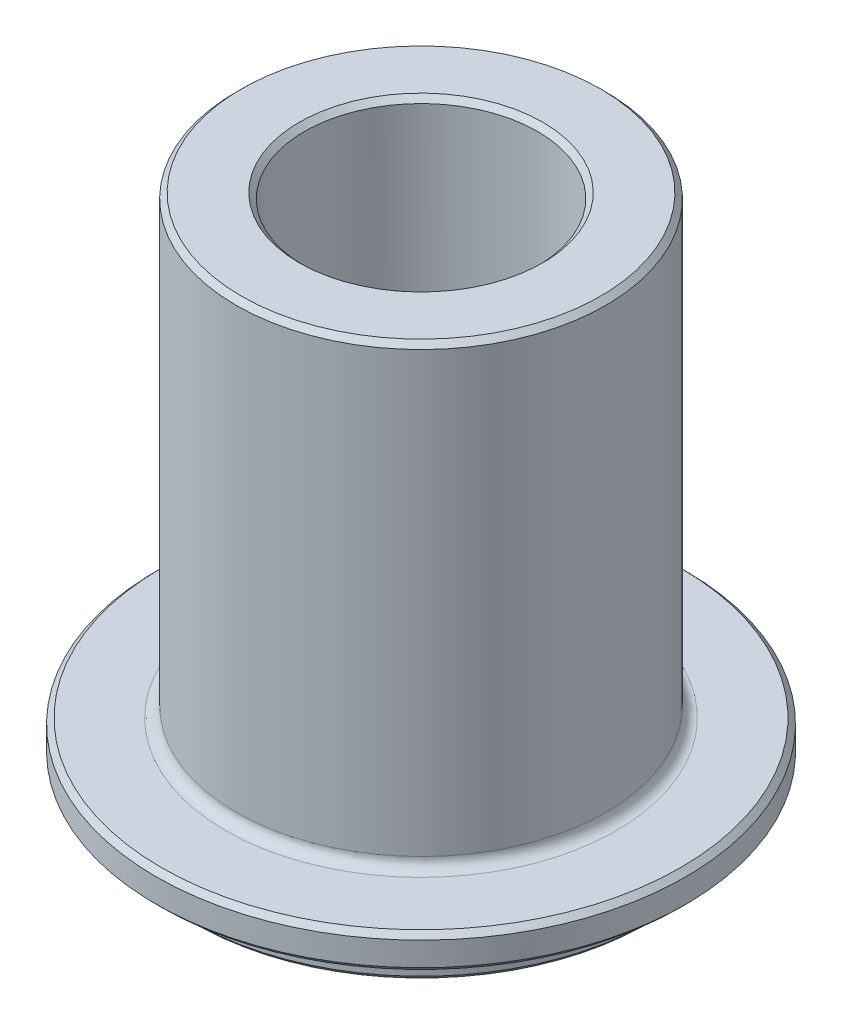
ISO-10303-21;
HEADER;
FILE_DESCRIPTION(('STEP AP214'),'2;1');
FILE_NAME('part.step','',(''),(''),'','','');
FILE_SCHEMA(('AUTOMOTIVE_DESIGN { 1 0 10303 214 1 1 1 1 }'));
ENDSEC;
DATA;
#1=APPLICATION_CONTEXT('core data for automotive mechanical design processes');
#2=APPLICATION_PROTOCOL_DEFINITION('international standard','automotive_design',2000,#1);
#3=PRODUCT_CONTEXT('',#1,'mechanical');
#4=PRODUCT('Part','Part','',(#3));
#5=PRODUCT_RELATED_PRODUCT_CATEGORY('part','',(#4));
#6=PRODUCT_DEFINITION_FORMATION('','',#4);
#7=PRODUCT_DEFINITION_CONTEXT('part definition',#1,'design');
#8=PRODUCT_DEFINITION('design','',#6,#7);
#9=PRODUCT_DEFINITION_SHAPE('','',#8);
#10=(LENGTH_UNIT() NAMED_UNIT(*) SI_UNIT(.MILLI.,.METRE.));
#11=(NAMED_UNIT(*) PLANE_ANGLE_UNIT() SI_UNIT($,.RADIAN.));
#12=(NAMED_UNIT(*) SI_UNIT($,.STERADIAN.) SOLID_ANGLE_UNIT());
#13=UNCERTAINTY_MEASURE_WITH_UNIT(LENGTH_MEASURE(1.E-05),#10,'distance_accuracy_value','');
#14=(GEOMETRIC_REPRESENTATION_CONTEXT(3) GLOBAL_UNCERTAINTY_ASSIGNED_CONTEXT((#13)) GLOBAL_UNIT_ASSIGNED_CONTEXT((#10,
#11,#12)) REPRESENTATION_CONTEXT('',''));
#15=CARTESIAN_POINT('',(0.,0.,0.));
#16=DIRECTION('',(0.,0.,1.));
#17=DIRECTION('',(1.,0.,0.));
#18=AXIS2_PLACEMENT_3D('',#15,#16,#17);
#19=CARTESIAN_POINT('',(0.,27.8,0.));
#20=DIRECTION('',(0.,1.,0.));
#21=DIRECTION('',(0.,0.,1.));
#22=AXIS2_PLACEMENT_3D('',#19,#20,#21);
#23=CONICAL_SURFACE('',#22,1.49303844590048,1.0518523930485);
#24=CARTESIAN_POINT('',(0.,33.23,0.));
#25=DIRECTION('',(0.,-1.,0.));
#26=DIRECTION('',(0.,0.,-1.));
#27=AXIS2_PLACEMENT_3D('',#24,#25,#26);
#28=CIRCLE('',#27,11.);
#29=CARTESIAN_POINT('',(0.,33.23,-11.));
#30=VERTEX_POINT('',#29);
#31=EDGE_CURVE('E130',#30,#30,#28,.T.);
#32=ORIENTED_EDGE('',*,*,#31,.F.);
#33=EDGE_LOOP('',(#32));
#34=FACE_BOUND('',#33,.T.);
#35=CARTESIAN_POINT('',(0.,27.8,0.));
#36=DIRECTION('',(0.,-1.,0.));
#37=DIRECTION('',(0.,0.,-1.));
#38=AXIS2_PLACEMENT_3D('',#35,#36,#37);
#39=CIRCLE('',#38,1.49303844590048);
#40=CARTESIAN_POINT('',(0.,27.8,-1.49303844590048));
#41=VERTEX_POINT('',#40);
#42=EDGE_CURVE('E122',#41,#41,#39,.T.);
#43=ORIENTED_EDGE('',*,*,#42,.T.);
#44=EDGE_LOOP('',(#43));
#45=FACE_BOUND('',#44,.T.);
#46=ADVANCED_FACE('F41',(#34,#45),#23,.F.);
#47=CARTESIAN_POINT('',(0.,0.,0.));
#48=DIRECTION('',(0.,-1.,0.));
#49=DIRECTION('',(0.,0.,-1.));
#50=AXIS2_PLACEMENT_3D('',#47,#48,#49);
#51=CYLINDRICAL_SURFACE('',#50,1.49303844590048);
#52=CARTESIAN_POINT('',(0.,25.8,0.));
#53=DIRECTION('',(0.,1.,0.));
#54=DIRECTION('',(0.,0.,1.));
#55=AXIS2_PLACEMENT_3D('',#52,#53,#54);
#56=CIRCLE('',#55,1.49303844590048);
#57=CARTESIAN_POINT('',(0.,25.8,1.49303844590048));
#58=VERTEX_POINT('',#57);
#59=EDGE_CURVE('E86',#58,#58,#56,.F.);
#60=ORIENTED_EDGE('',*,*,#59,.T.);
#61=EDGE_LOOP('',(#60));
#62=FACE_BOUND('',#61,.T.);
#63=ORIENTED_EDGE('',*,*,#42,.F.);
#64=EDGE_LOOP('',(#63));
#65=FACE_BOUND('',#64,.T.);
#66=ADVANCED_FACE('F139',(#62,#65),#51,.F.);
#67=CARTESIAN_POINT('',(0.,25.3,0.));
#68=DIRECTION('',(0.,1.,0.));
#69=DIRECTION('',(0.,0.,1.));
#70=AXIS2_PLACEMENT_3D('',#67,#68,#69);
#71=PLANE('',#70);
#72=CARTESIAN_POINT('',(0.,25.3,0.));
#73=DIRECTION('',(0.,1.,0.));
#74=DIRECTION('',(0.,0.,1.));
#75=AXIS2_PLACEMENT_3D('',#72,#73,#74);
#76=CIRCLE('',#75,11.8346398960364);
#77=CARTESIAN_POINT('',(0.,25.3,11.8346398960364));
#78=VERTEX_POINT('',#77);
#79=EDGE_CURVE('E50',#78,#78,#76,.F.);
#80=ORIENTED_EDGE('',*,*,#79,.T.);
#81=EDGE_LOOP('',(#80));
#82=FACE_BOUND('',#81,.T.);
#83=CARTESIAN_POINT('',(0.,25.3,0.));
#84=DIRECTION('',(0.,1.,0.));
#85=DIRECTION('',(0.,0.,1.));
#86=AXIS2_PLACEMENT_3D('',#83,#84,#85);
#87=CIRCLE('',#86,1.9930384459005);
#88=CARTESIAN_POINT('',(0.,25.3,1.9930384459005));
#89=VERTEX_POINT('',#88);
#90=EDGE_CURVE('E82',#89,#89,#87,.T.);
#91=ORIENTED_EDGE('',*,*,#90,.T.);
#92=EDGE_LOOP('',(#91));
#93=FACE_BOUND('',#92,.T.);
#94=ADVANCED_FACE('F144',(#82,#93),#71,.F.);
#95=CARTESIAN_POINT('',(0.,0.,0.));
#96=DIRECTION('',(0.,-1.,0.));
#97=DIRECTION('',(0.,0.,-1.));
#98=AXIS2_PLACEMENT_3D('',#95,#96,#97);
#99=CYLINDRICAL_SURFACE('',#98,12.3346398960364);
#100=CARTESIAN_POINT('',(0.,24.8,0.));
#101=DIRECTION('',(0.,1.,0.));
#102=DIRECTION('',(0.,0.,1.));
#103=AXIS2_PLACEMENT_3D('',#100,#101,#102);
#104=CIRCLE('',#103,12.3346398960364);
#105=CARTESIAN_POINT('',(0.,24.8,12.3346398960364));
#106=VERTEX_POINT('',#105);
#107=EDGE_CURVE('E10',#106,#106,#104,.T.);
#108=ORIENTED_EDGE('',*,*,#107,.T.);
#109=EDGE_LOOP('',(#108));
#110=FACE_BOUND('',#109,.T.);
#111=CARTESIAN_POINT('',(0.,0.500000000000023,0.));
#112=DIRECTION('',(0.,-1.,0.));
#113=DIRECTION('',(0.,0.,-1.));
#114=AXIS2_PLACEMENT_3D('',#111,#112,#113);
#115=CIRCLE('',#114,12.3346398960364);
#116=CARTESIAN_POINT('',(0.,0.500000000000023,-12.3346398960364));
#117=VERTEX_POINT('',#116);
#118=EDGE_CURVE('E90',#117,#117,#115,.T.);
#119=ORIENTED_EDGE('',*,*,#118,.T.);
#120=EDGE_LOOP('',(#119));
#121=FACE_BOUND('',#120,.T.);
#122=ADVANCED_FACE('F150',(#110,#121),#99,.F.);
#123=CARTESIAN_POINT('',(0.,0.,0.));
#124=DIRECTION('',(0.,-1.,0.));
#125=DIRECTION('',(0.,0.,-1.));
#126=AXIS2_PLACEMENT_3D('',#123,#124,#125);
#127=PLANE('',#126);
#128=CARTESIAN_POINT('',(0.,0.,0.));
#129=DIRECTION('',(0.,-1.,0.));
#130=DIRECTION('',(0.,0.,-1.));
#131=AXIS2_PLACEMENT_3D('',#128,#129,#130);
#132=CIRCLE('',#131,21.25);
#133=CARTESIAN_POINT('',(0.,0.,-21.25));
#134=VERTEX_POINT('',#133);
#135=EDGE_CURVE('E98',#134,#134,#132,.T.);
#136=ORIENTED_EDGE('',*,*,#135,.T.);
#137=EDGE_LOOP('',(#136));
#138=FACE_BOUND('',#137,.T.);
#139=CARTESIAN_POINT('',(0.,0.,0.));
#140=DIRECTION('',(0.,-1.,0.));
#141=DIRECTION('',(0.,0.,-1.));
#142=AXIS2_PLACEMENT_3D('',#139,#140,#141);
#143=CIRCLE('',#142,12.8346398960364);
#144=CARTESIAN_POINT('',(0.,0.,-12.8346398960364));
#145=VERTEX_POINT('',#144);
#146=EDGE_CURVE('E102',#145,#145,#143,.F.);
#147=ORIENTED_EDGE('',*,*,#146,.T.);
#148=EDGE_LOOP('',(#147));
#149=FACE_BOUND('',#148,.T.);
#150=ADVANCED_FACE('F238',(#138,#149),#127,.T.);
#151=CARTESIAN_POINT('',(0.,0.,0.));
#152=DIRECTION('',(0.,-1.,0.));
#153=DIRECTION('',(0.,0.,-1.));
#154=AXIS2_PLACEMENT_3D('',#151,#152,#153);
#155=CYLINDRICAL_SURFACE('',#154,21.75);
#156=CARTESIAN_POINT('',(0.,0.500000000000004,0.));
#157=DIRECTION('',(0.,-1.,0.));
#158=DIRECTION('',(0.,0.,-1.));
#159=AXIS2_PLACEMENT_3D('',#156,#157,#158);
#160=CIRCLE('',#159,21.75);
#161=CARTESIAN_POINT('',(0.,0.500000000000004,-21.75));
#162=VERTEX_POINT('',#161);
#163=EDGE_CURVE('E94',#162,#162,#160,.F.);
#164=ORIENTED_EDGE('',*,*,#163,.T.);
#165=EDGE_LOOP('',(#164));
#166=FACE_BOUND('',#165,.T.);
#167=CARTESIAN_POINT('',(0.,3.,0.));
#168=DIRECTION('',(0.,-1.,0.));
#169=DIRECTION('',(0.,0.,-1.));
#170=AXIS2_PLACEMENT_3D('',#167,#168,#169);
#171=CIRCLE('',#170,21.75);
#172=CARTESIAN_POINT('',(0.,3.,-21.75));
#173=VERTEX_POINT('',#172);
#174=EDGE_CURVE('E126',#173,#173,#171,.T.);
#175=ORIENTED_EDGE('',*,*,#174,.T.);
#176=EDGE_LOOP('',(#175));
#177=FACE_BOUND('',#176,.T.);
#178=ADVANCED_FACE('F233',(#166,#177),#155,.T.);
#179=CARTESIAN_POINT('',(0.,3.,0.));
#180=DIRECTION('',(0.,-1.,0.));
#181=DIRECTION('',(0.,0.,-1.));
#182=AXIS2_PLACEMENT_3D('',#179,#180,#181);
#183=PLANE('',#182);
#184=CARTESIAN_POINT('',(0.,3.,0.));
#185=DIRECTION('',(0.,-1.,0.));
#186=DIRECTION('',(0.,0.,-1.));
#187=AXIS2_PLACEMENT_3D('',#184,#185,#186);
#188=CIRCLE('',#187,24.5);
#189=CARTESIAN_POINT('',(0.,3.,-24.5));
#190=VERTEX_POINT('',#189);
#191=EDGE_CURVE('E106',#190,#190,#188,.T.);
#192=ORIENTED_EDGE('',*,*,#191,.T.);
#193=EDGE_LOOP('',(#192));
#194=FACE_BOUND('',#193,.T.);
#195=ORIENTED_EDGE('',*,*,#174,.F.);
#196=EDGE_LOOP('',(#195));
#197=FACE_BOUND('',#196,.T.);
#198=ADVANCED_FACE('F225',(#194,#197),#183,.T.);
#199=CARTESIAN_POINT('',(0.,0.,0.));
#200=DIRECTION('',(0.,-1.,0.));
#201=DIRECTION('',(0.,0.,-1.));
#202=AXIS2_PLACEMENT_3D('',#199,#200,#201);
#203=CYLINDRICAL_SURFACE('',#202,25.);
#204=CARTESIAN_POINT('',(0.,5.74999999999999,0.));
#205=DIRECTION('',(0.,1.,0.));
#206=DIRECTION('',(0.,0.,1.));
#207=AXIS2_PLACEMENT_3D('',#204,#205,#206);
#208=CIRCLE('',#207,25.);
#209=CARTESIAN_POINT('',(0.,5.74999999999999,25.));
#210=VERTEX_POINT('',#209);
#211=EDGE_CURVE('E114',#210,#210,#208,.F.);
#212=ORIENTED_EDGE('',*,*,#211,.T.);
#213=EDGE_LOOP('',(#212));
#214=FACE_BOUND('',#213,.T.);
#215=CARTESIAN_POINT('',(0.,3.5,0.));
#216=DIRECTION('',(0.,-1.,0.));
#217=DIRECTION('',(0.,0.,-1.));
#218=AXIS2_PLACEMENT_3D('',#215,#216,#217);
#219=CIRCLE('',#218,25.);
#220=CARTESIAN_POINT('',(0.,3.5,-25.));
#221=VERTEX_POINT('',#220);
#222=EDGE_CURVE('E118',#221,#221,#219,.F.);
#223=ORIENTED_EDGE('',*,*,#222,.T.);
#224=EDGE_LOOP('',(#223));
#225=FACE_BOUND('',#224,.T.);
#226=ADVANCED_FACE('F217',(#214,#225),#203,.T.);
#227=CARTESIAN_POINT('',(0.,6.25,0.));
#228=DIRECTION('',(0.,1.,0.));
#229=DIRECTION('',(0.,0.,1.));
#230=AXIS2_PLACEMENT_3D('',#227,#228,#229);
#231=PLANE('',#230);
#232=CARTESIAN_POINT('',(0.,6.25,0.));
#233=DIRECTION('',(0.,1.,0.));
#234=DIRECTION('',(0.,0.,1.));
#235=AXIS2_PLACEMENT_3D('',#232,#233,#234);
#236=CIRCLE('',#235,18.45);
#237=CARTESIAN_POINT('',(0.,6.25,18.45));
#238=VERTEX_POINT('',#237);
#239=EDGE_CURVE('E60',#238,#238,#236,.F.);
#240=ORIENTED_EDGE('',*,*,#239,.T.);
#241=EDGE_LOOP('',(#240));
#242=FACE_BOUND('',#241,.T.);
#243=CARTESIAN_POINT('',(0.,6.25,0.));
#244=DIRECTION('',(0.,1.,0.));
#245=DIRECTION('',(0.,0.,1.));
#246=AXIS2_PLACEMENT_3D('',#243,#244,#245);
#247=CIRCLE('',#246,24.5);
#248=CARTESIAN_POINT('',(0.,6.25,24.5));
#249=VERTEX_POINT('',#248);
#250=EDGE_CURVE('E110',#249,#249,#247,.T.);
#251=ORIENTED_EDGE('',*,*,#250,.T.);
#252=EDGE_LOOP('',(#251));
#253=FACE_BOUND('',#252,.T.);
#254=ADVANCED_FACE('F213',(#242,#253),#231,.T.);
#255=CARTESIAN_POINT('',(0.,0.,0.));
#256=DIRECTION('',(0.,-1.,0.));
#257=DIRECTION('',(0.,0.,-1.));
#258=AXIS2_PLACEMENT_3D('',#255,#256,#257);
#259=CYLINDRICAL_SURFACE('',#258,17.45);
#260=CARTESIAN_POINT('',(0.,7.25,0.));
#261=DIRECTION('',(0.,1.,0.));
#262=DIRECTION('',(0.,0.,1.));
#263=AXIS2_PLACEMENT_3D('',#260,#261,#262);
#264=CIRCLE('',#263,17.45);
#265=CARTESIAN_POINT('',(0.,7.25,17.45));
#266=VERTEX_POINT('',#265);
#267=EDGE_CURVE('E55',#266,#266,#264,.T.);
#268=ORIENTED_EDGE('',*,*,#267,.T.);
#269=EDGE_LOOP('',(#268));
#270=FACE_BOUND('',#269,.T.);
#271=CARTESIAN_POINT('',(0.,48.7,0.));
#272=DIRECTION('',(0.,1.,0.));
#273=DIRECTION('',(0.,0.,1.));
#274=AXIS2_PLACEMENT_3D('',#271,#272,#273);
#275=CIRCLE('',#274,17.45);
#276=CARTESIAN_POINT('',(0.,48.7,17.45));
#277=VERTEX_POINT('',#276);
#278=EDGE_CURVE('E66',#277,#277,#275,.F.);
#279=ORIENTED_EDGE('',*,*,#278,.T.);
#280=EDGE_LOOP('',(#279));
#281=FACE_BOUND('',#280,.T.);
#282=ADVANCED_FACE('F216',(#270,#281),#259,.T.);
#283=CARTESIAN_POINT('',(0.,49.2,0.));
#284=DIRECTION('',(0.,1.,0.));
#285=DIRECTION('',(0.,0.,1.));
#286=AXIS2_PLACEMENT_3D('',#283,#284,#285);
#287=PLANE('',#286);
#288=CARTESIAN_POINT('',(0.,49.2,0.));
#289=DIRECTION('',(0.,1.,0.));
#290=DIRECTION('',(0.,0.,1.));
#291=AXIS2_PLACEMENT_3D('',#288,#289,#290);
#292=CIRCLE('',#291,11.5);
#293=CARTESIAN_POINT('',(0.,49.2,11.5));
#294=VERTEX_POINT('',#293);
#295=EDGE_CURVE('E74',#294,#294,#292,.F.);
#296=ORIENTED_EDGE('',*,*,#295,.T.);
#297=EDGE_LOOP('',(#296));
#298=FACE_BOUND('',#297,.T.);
#299=CARTESIAN_POINT('',(0.,49.2,0.));
#300=DIRECTION('',(0.,1.,0.));
#301=DIRECTION('',(0.,0.,1.));
#302=AXIS2_PLACEMENT_3D('',#299,#300,#301);
#303=CIRCLE('',#302,16.95);
#304=CARTESIAN_POINT('',(0.,49.2,16.95));
#305=VERTEX_POINT('',#304);
#306=EDGE_CURVE('E78',#305,#305,#303,.T.);
#307=ORIENTED_EDGE('',*,*,#306,.T.);
#308=EDGE_LOOP('',(#307));
#309=FACE_BOUND('',#308,.T.);
#310=ADVANCED_FACE('F284',(#298,#309),#287,.T.);
#311=CARTESIAN_POINT('',(0.,0.,0.));
#312=DIRECTION('',(0.,-1.,0.));
#313=DIRECTION('',(0.,0.,-1.));
#314=AXIS2_PLACEMENT_3D('',#311,#312,#313);
#315=CYLINDRICAL_SURFACE('',#314,11.);
#316=CARTESIAN_POINT('',(0.,48.7,0.));
#317=DIRECTION('',(0.,1.,0.));
#318=DIRECTION('',(0.,0.,1.));
#319=AXIS2_PLACEMENT_3D('',#316,#317,#318);
#320=CIRCLE('',#319,11.);
#321=CARTESIAN_POINT('',(0.,48.7,11.));
#322=VERTEX_POINT('',#321);
#323=EDGE_CURVE('E70',#322,#322,#320,.T.);
#324=ORIENTED_EDGE('',*,*,#323,.T.);
#325=EDGE_LOOP('',(#324));
#326=FACE_BOUND('',#325,.T.);
#327=ORIENTED_EDGE('',*,*,#31,.T.);
#328=EDGE_LOOP('',(#327));
#329=FACE_BOUND('',#328,.T.);
#330=ADVANCED_FACE('F135',(#326,#329),#315,.F.);
#331=CARTESIAN_POINT('',(0.,5.74999999999999,0.));
#332=DIRECTION('',(0.,-1.,0.));
#333=DIRECTION('',(0.,0.,-1.));
#334=AXIS2_PLACEMENT_3D('',#331,#332,#333);
#335=CONICAL_SURFACE('',#334,25.,0.785398163397452);
#336=ORIENTED_EDGE('',*,*,#250,.F.);
#337=EDGE_LOOP('',(#336));
#338=FACE_BOUND('',#337,.T.);
#339=ORIENTED_EDGE('',*,*,#211,.F.);
#340=EDGE_LOOP('',(#339));
#341=FACE_BOUND('',#340,.T.);
#342=ADVANCED_FACE('F155',(#338,#341),#335,.T.);
#343=CARTESIAN_POINT('',(0.,3.,0.));
#344=DIRECTION('',(0.,1.,0.));
#345=DIRECTION('',(0.,0.,1.));
#346=AXIS2_PLACEMENT_3D('',#343,#344,#345);
#347=CONICAL_SURFACE('',#346,24.5,0.785398163397438);
#348=ORIENTED_EDGE('',*,*,#222,.F.);
#349=EDGE_LOOP('',(#348));
#350=FACE_BOUND('',#349,.T.);
#351=ORIENTED_EDGE('',*,*,#191,.F.);
#352=EDGE_LOOP('',(#351));
#353=FACE_BOUND('',#352,.T.);
#354=ADVANCED_FACE('F161',(#350,#353),#347,.T.);
#355=CARTESIAN_POINT('',(0.,0.,0.));
#356=DIRECTION('',(0.,1.,0.));
#357=DIRECTION('',(0.,0.,1.));
#358=AXIS2_PLACEMENT_3D('',#355,#356,#357);
#359=CONICAL_SURFACE('',#358,21.25,0.785398163397452);
#360=ORIENTED_EDGE('',*,*,#163,.F.);
#361=EDGE_LOOP('',(#360));
#362=FACE_BOUND('',#361,.T.);
#363=ORIENTED_EDGE('',*,*,#135,.F.);
#364=EDGE_LOOP('',(#363));
#365=FACE_BOUND('',#364,.T.);
#366=ADVANCED_FACE('F168',(#362,#365),#359,.T.);
#367=CARTESIAN_POINT('',(0.,0.500000000000023,0.));
#368=DIRECTION('',(0.,-1.,0.));
#369=DIRECTION('',(0.,0.,-1.));
#370=AXIS2_PLACEMENT_3D('',#367,#368,#369);
#371=CONICAL_SURFACE('',#370,12.3346398960364,0.785398163397447);
#372=ORIENTED_EDGE('',*,*,#146,.F.);
#373=EDGE_LOOP('',(#372));
#374=FACE_BOUND('',#373,.T.);
#375=ORIENTED_EDGE('',*,*,#118,.F.);
#376=EDGE_LOOP('',(#375));
#377=FACE_BOUND('',#376,.T.);
#378=ADVANCED_FACE('F175',(#374,#377),#371,.F.);
#379=CARTESIAN_POINT('',(0.,25.8,0.));
#380=DIRECTION('',(0.,-1.,0.));
#381=DIRECTION('',(0.,0.,-1.));
#382=AXIS2_PLACEMENT_3D('',#379,#380,#381);
#383=CONICAL_SURFACE('',#382,1.49303844590048,0.785398163397462);
#384=ORIENTED_EDGE('',*,*,#90,.F.);
#385=EDGE_LOOP('',(#384));
#386=FACE_BOUND('',#385,.T.);
#387=ORIENTED_EDGE('',*,*,#59,.F.);
#388=EDGE_LOOP('',(#387));
#389=FACE_BOUND('',#388,.T.);
#390=ADVANCED_FACE('F182',(#386,#389),#383,.F.);
#391=CARTESIAN_POINT('',(0.,49.2,0.));
#392=DIRECTION('',(0.,1.,0.));
#393=DIRECTION('',(0.,0.,1.));
#394=AXIS2_PLACEMENT_3D('',#391,#392,#393);
#395=CONICAL_SURFACE('',#394,11.5,0.785398163397443);
#396=ORIENTED_EDGE('',*,*,#323,.F.);
#397=EDGE_LOOP('',(#396));
#398=FACE_BOUND('',#397,.T.);
#399=ORIENTED_EDGE('',*,*,#295,.F.);
#400=EDGE_LOOP('',(#399));
#401=FACE_BOUND('',#400,.T.);
#402=ADVANCED_FACE('F189',(#398,#401),#395,.F.);
#403=CARTESIAN_POINT('',(0.,48.7,0.));
#404=DIRECTION('',(0.,-1.,0.));
#405=DIRECTION('',(0.,0.,-1.));
#406=AXIS2_PLACEMENT_3D('',#403,#404,#405);
#407=CONICAL_SURFACE('',#406,17.45,0.785398163397448);
#408=ORIENTED_EDGE('',*,*,#306,.F.);
#409=EDGE_LOOP('',(#408));
#410=FACE_BOUND('',#409,.T.);
#411=ORIENTED_EDGE('',*,*,#278,.F.);
#412=EDGE_LOOP('',(#411));
#413=FACE_BOUND('',#412,.T.);
#414=ADVANCED_FACE('F196',(#410,#413),#407,.T.);
#415=CARTESIAN_POINT('',(0.,7.25,0.));
#416=DIRECTION('',(0.,1.,0.));
#417=DIRECTION('',(0.,0.,1.));
#418=AXIS2_PLACEMENT_3D('',#415,#416,#417);
#419=TOROIDAL_SURFACE('',#418,18.45,1.);
#420=ORIENTED_EDGE('',*,*,#267,.F.);
#421=EDGE_LOOP('',(#420));
#422=FACE_BOUND('',#421,.T.);
#423=ORIENTED_EDGE('',*,*,#239,.F.);
#424=EDGE_LOOP('',(#423));
#425=FACE_BOUND('',#424,.T.);
#426=ADVANCED_FACE('F201',(#422,#425),#419,.F.);
#427=CARTESIAN_POINT('',(0.,25.3,0.));
#428=DIRECTION('',(0.,-1.,0.));
#429=DIRECTION('',(0.,0.,-1.));
#430=AXIS2_PLACEMENT_3D('',#427,#428,#429);
#431=CONICAL_SURFACE('',#430,11.8346398960364,0.785398163397441);
#432=ORIENTED_EDGE('',*,*,#107,.F.);
#433=EDGE_LOOP('',(#432));
#434=FACE_BOUND('',#433,.T.);
#435=ORIENTED_EDGE('',*,*,#79,.F.);
#436=EDGE_LOOP('',(#435));
#437=FACE_BOUND('',#436,.T.);
#438=ADVANCED_FACE('F44',(#434,#437),#431,.F.);
#439=CLOSED_SHELL('',(#46,#66,#94,#122,#150,#178,#198,#226,#254,#282,#310,#330,#342,#354,#366,
#378,#390,#402,#414,#426,#438));
#440=MANIFOLD_SOLID_BREP('B2',#439);
#441=ADVANCED_BREP_SHAPE_REPRESENTATION('',(#18,#440),#14);
#442=SHAPE_DEFINITION_REPRESENTATION(#9,#441);
ENDSEC;
END-ISO-10303-21;
